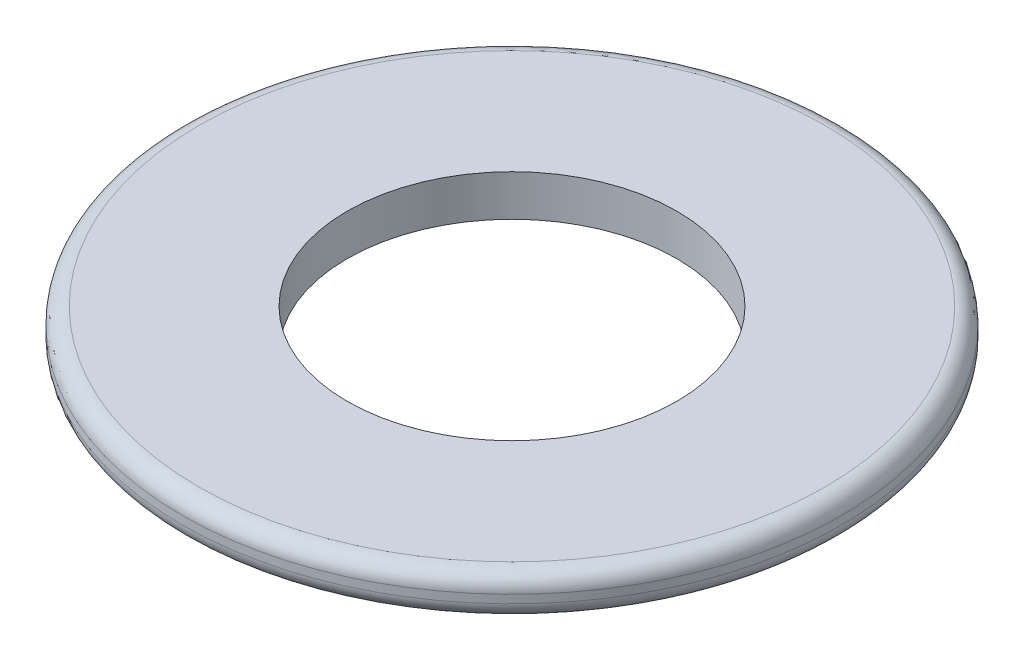
ISO-10303-21;
HEADER;
FILE_DESCRIPTION(('STEP AP214'),'2;1');
FILE_NAME('part.step','',(''),(''),'','','');
FILE_SCHEMA(('AUTOMOTIVE_DESIGN { 1 0 10303 214 1 1 1 1 }'));
ENDSEC;
DATA;
#1=APPLICATION_CONTEXT('core data for automotive mechanical design processes');
#2=APPLICATION_PROTOCOL_DEFINITION('international standard','automotive_design',2000,#1);
#3=PRODUCT_CONTEXT('',#1,'mechanical');
#4=PRODUCT('Part','Part','',(#3));
#5=PRODUCT_RELATED_PRODUCT_CATEGORY('part','',(#4));
#6=PRODUCT_DEFINITION_FORMATION('','',#4);
#7=PRODUCT_DEFINITION_CONTEXT('part definition',#1,'design');
#8=PRODUCT_DEFINITION('design','',#6,#7);
#9=PRODUCT_DEFINITION_SHAPE('','',#8);
#10=(LENGTH_UNIT() NAMED_UNIT(*) SI_UNIT(.MILLI.,.METRE.));
#11=(NAMED_UNIT(*) PLANE_ANGLE_UNIT() SI_UNIT($,.RADIAN.));
#12=(NAMED_UNIT(*) SI_UNIT($,.STERADIAN.) SOLID_ANGLE_UNIT());
#13=UNCERTAINTY_MEASURE_WITH_UNIT(LENGTH_MEASURE(1.E-05),#10,'distance_accuracy_value','');
#14=(GEOMETRIC_REPRESENTATION_CONTEXT(3) GLOBAL_UNCERTAINTY_ASSIGNED_CONTEXT((#13)) GLOBAL_UNIT_ASSIGNED_CONTEXT((#10,
#11,#12)) REPRESENTATION_CONTEXT('',''));
#15=CARTESIAN_POINT('',(0.,0.,0.));
#16=DIRECTION('',(0.,0.,1.));
#17=DIRECTION('',(1.,0.,0.));
#18=AXIS2_PLACEMENT_3D('',#15,#16,#17);
#19=CARTESIAN_POINT('',(0.,0.5,0.));
#20=DIRECTION('',(0.,1.,0.));
#21=DIRECTION('',(0.,0.,1.));
#22=AXIS2_PLACEMENT_3D('',#19,#20,#21);
#23=PLANE('',#22);
#24=CARTESIAN_POINT('',(0.,0.5,0.));
#25=DIRECTION('',(0.,1.,0.));
#26=DIRECTION('',(0.,0.,1.));
#27=AXIS2_PLACEMENT_3D('',#24,#25,#26);
#28=CIRCLE('',#27,3.8);
#29=CARTESIAN_POINT('',(0.,0.5,3.8));
#30=VERTEX_POINT('',#29);
#31=EDGE_CURVE('E46',#30,#30,#28,.T.);
#32=ORIENTED_EDGE('',*,*,#31,.T.);
#33=EDGE_LOOP('',(#32));
#34=FACE_BOUND('',#33,.T.);
#35=CARTESIAN_POINT('',(0.,0.5,0.));
#36=DIRECTION('',(0.,1.,0.));
#37=DIRECTION('',(0.,0.,1.));
#38=AXIS2_PLACEMENT_3D('',#35,#36,#37);
#39=CIRCLE('',#38,2.);
#40=CARTESIAN_POINT('',(0.,0.5,2.));
#41=VERTEX_POINT('',#40);
#42=EDGE_CURVE('E51',#41,#41,#39,.T.);
#43=ORIENTED_EDGE('',*,*,#42,.F.);
#44=EDGE_LOOP('',(#43));
#45=FACE_BOUND('',#44,.T.);
#46=ADVANCED_FACE('F31',(#34,#45),#23,.T.);
#47=CARTESIAN_POINT('',(0.,0.,0.));
#48=DIRECTION('',(0.,1.,0.));
#49=DIRECTION('',(0.,0.,1.));
#50=AXIS2_PLACEMENT_3D('',#47,#48,#49);
#51=PLANE('',#50);
#52=CARTESIAN_POINT('',(0.,0.,0.));
#53=DIRECTION('',(0.,1.,0.));
#54=DIRECTION('',(0.,0.,1.));
#55=AXIS2_PLACEMENT_3D('',#52,#53,#54);
#56=CIRCLE('',#55,3.8);
#57=CARTESIAN_POINT('',(0.,0.,3.8));
#58=VERTEX_POINT('',#57);
#59=EDGE_CURVE('E10',#58,#58,#56,.F.);
#60=ORIENTED_EDGE('',*,*,#59,.T.);
#61=EDGE_LOOP('',(#60));
#62=FACE_BOUND('',#61,.T.);
#63=CARTESIAN_POINT('',(0.,0.,0.));
#64=DIRECTION('',(0.,1.,0.));
#65=DIRECTION('',(0.,0.,1.));
#66=AXIS2_PLACEMENT_3D('',#63,#64,#65);
#67=CIRCLE('',#66,2.);
#68=CARTESIAN_POINT('',(0.,0.,2.));
#69=VERTEX_POINT('',#68);
#70=EDGE_CURVE('E52',#69,#69,#67,.T.);
#71=ORIENTED_EDGE('',*,*,#70,.T.);
#72=EDGE_LOOP('',(#71));
#73=FACE_BOUND('',#72,.T.);
#74=ADVANCED_FACE('F62',(#62,#73),#51,.F.);
#75=CARTESIAN_POINT('',(0.,0.5,0.));
#76=DIRECTION('',(0.,-1.,0.));
#77=DIRECTION('',(0.,0.,-1.));
#78=AXIS2_PLACEMENT_3D('',#75,#76,#77);
#79=CYLINDRICAL_SURFACE('',#78,4.);
#80=CARTESIAN_POINT('',(0.,0.2,0.));
#81=DIRECTION('',(0.,1.,0.));
#82=DIRECTION('',(0.,0.,1.));
#83=AXIS2_PLACEMENT_3D('',#80,#81,#82);
#84=CIRCLE('',#83,4.);
#85=CARTESIAN_POINT('',(0.,0.2,4.));
#86=VERTEX_POINT('',#85);
#87=EDGE_CURVE('E38',#86,#86,#84,.T.);
#88=ORIENTED_EDGE('',*,*,#87,.T.);
#89=EDGE_LOOP('',(#88));
#90=FACE_BOUND('',#89,.T.);
#91=CARTESIAN_POINT('',(0.,0.3,0.));
#92=DIRECTION('',(0.,1.,0.));
#93=DIRECTION('',(0.,0.,1.));
#94=AXIS2_PLACEMENT_3D('',#91,#92,#93);
#95=CIRCLE('',#94,4.);
#96=CARTESIAN_POINT('',(0.,0.3,4.));
#97=VERTEX_POINT('',#96);
#98=EDGE_CURVE('E42',#97,#97,#95,.F.);
#99=ORIENTED_EDGE('',*,*,#98,.T.);
#100=EDGE_LOOP('',(#99));
#101=FACE_BOUND('',#100,.T.);
#102=ADVANCED_FACE('F68',(#90,#101),#79,.T.);
#103=CARTESIAN_POINT('',(0.,0.5,0.));
#104=DIRECTION('',(0.,-1.,0.));
#105=DIRECTION('',(0.,0.,-1.));
#106=AXIS2_PLACEMENT_3D('',#103,#104,#105);
#107=CYLINDRICAL_SURFACE('',#106,2.);
#108=ORIENTED_EDGE('',*,*,#42,.T.);
#109=EDGE_LOOP('',(#108));
#110=FACE_BOUND('',#109,.T.);
#111=ORIENTED_EDGE('',*,*,#70,.F.);
#112=EDGE_LOOP('',(#111));
#113=FACE_BOUND('',#112,.T.);
#114=ADVANCED_FACE('F58',(#110,#113),#107,.F.);
#115=CARTESIAN_POINT('',(0.,0.3,0.));
#116=DIRECTION('',(0.,1.,0.));
#117=DIRECTION('',(0.,0.,1.));
#118=AXIS2_PLACEMENT_3D('',#115,#116,#117);
#119=TOROIDAL_SURFACE('',#118,3.8,0.2);
#120=ORIENTED_EDGE('',*,*,#98,.F.);
#121=EDGE_LOOP('',(#120));
#122=FACE_BOUND('',#121,.T.);
#123=ORIENTED_EDGE('',*,*,#31,.F.);
#124=EDGE_LOOP('',(#123));
#125=FACE_BOUND('',#124,.T.);
#126=ADVANCED_FACE('F73',(#122,#125),#119,.T.);
#127=CARTESIAN_POINT('',(0.,0.2,0.));
#128=DIRECTION('',(0.,1.,0.));
#129=DIRECTION('',(0.,0.,1.));
#130=AXIS2_PLACEMENT_3D('',#127,#128,#129);
#131=TOROIDAL_SURFACE('',#130,3.8,0.2);
#132=ORIENTED_EDGE('',*,*,#59,.F.);
#133=EDGE_LOOP('',(#132));
#134=FACE_BOUND('',#133,.T.);
#135=ORIENTED_EDGE('',*,*,#87,.F.);
#136=EDGE_LOOP('',(#135));
#137=FACE_BOUND('',#136,.T.);
#138=ADVANCED_FACE('F33',(#134,#137),#131,.T.);
#139=CLOSED_SHELL('',(#46,#74,#102,#114,#126,#138));
#140=MANIFOLD_SOLID_BREP('B2',#139);
#141=ADVANCED_BREP_SHAPE_REPRESENTATION('',(#18,#140),#14);
#142=SHAPE_DEFINITION_REPRESENTATION(#9,#141);
ENDSEC;
END-ISO-10303-21;
